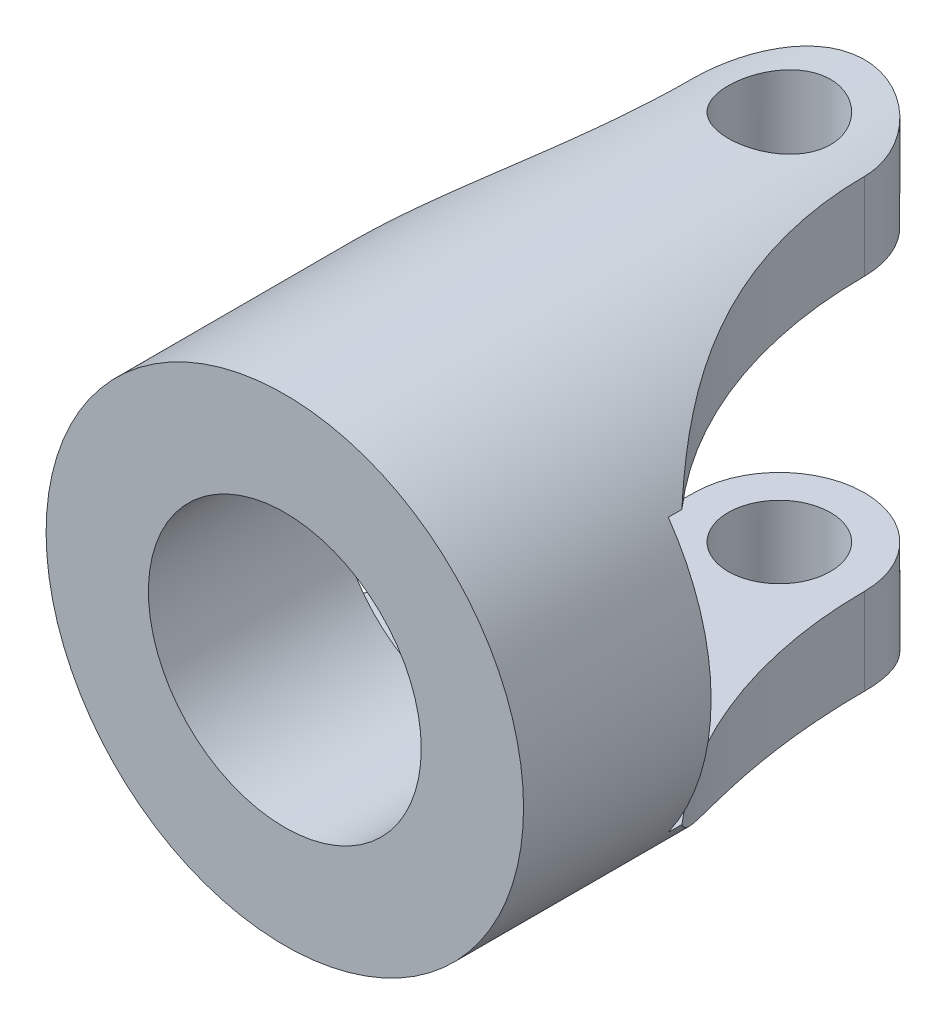
ISO-10303-21;
HEADER;
FILE_DESCRIPTION(('STEP AP214'),'2;1');
FILE_NAME('part.step','',(''),(''),'','','');
FILE_SCHEMA(('AUTOMOTIVE_DESIGN { 1 0 10303 214 1 1 1 1 }'));
ENDSEC;
DATA;
#1=APPLICATION_CONTEXT('core data for automotive mechanical design processes');
#2=APPLICATION_PROTOCOL_DEFINITION('international standard','automotive_design',2000,#1);
#3=PRODUCT_CONTEXT('',#1,'mechanical');
#4=PRODUCT('Part','Part','',(#3));
#5=PRODUCT_RELATED_PRODUCT_CATEGORY('part','',(#4));
#6=PRODUCT_DEFINITION_FORMATION('','',#4);
#7=PRODUCT_DEFINITION_CONTEXT('part definition',#1,'design');
#8=PRODUCT_DEFINITION('design','',#6,#7);
#9=PRODUCT_DEFINITION_SHAPE('','',#8);
#10=(LENGTH_UNIT() NAMED_UNIT(*) SI_UNIT(.MILLI.,.METRE.));
#11=(NAMED_UNIT(*) PLANE_ANGLE_UNIT() SI_UNIT($,.RADIAN.));
#12=(NAMED_UNIT(*) SI_UNIT($,.STERADIAN.) SOLID_ANGLE_UNIT());
#13=UNCERTAINTY_MEASURE_WITH_UNIT(LENGTH_MEASURE(1.E-05),#10,'distance_accuracy_value','');
#14=(GEOMETRIC_REPRESENTATION_CONTEXT(3) GLOBAL_UNCERTAINTY_ASSIGNED_CONTEXT((#13)) GLOBAL_UNIT_ASSIGNED_CONTEXT((#10,
#11,#12)) REPRESENTATION_CONTEXT('',''));
#15=CARTESIAN_POINT('',(0.,0.,0.));
#16=DIRECTION('',(0.,0.,1.));
#17=DIRECTION('',(1.,0.,0.));
#18=AXIS2_PLACEMENT_3D('',#15,#16,#17);
#19=CARTESIAN_POINT('',(15.5252924641516,-7.,2.49999999999999));
#20=DIRECTION('',(0.,1.,0.));
#21=DIRECTION('',(0.,0.,1.));
#22=AXIS2_PLACEMENT_3D('',#19,#20,#21);
#23=CYLINDRICAL_SURFACE('',#22,13.0252924641516);
#24=CARTESIAN_POINT('',(15.5252924641516,-4.,2.49999999999999));
#25=DIRECTION('',(0.,-1.,0.));
#26=DIRECTION('',(0.,0.,-1.));
#27=AXIS2_PLACEMENT_3D('',#24,#25,#26);
#28=CIRCLE('',#27,13.0252924641516);
#29=CARTESIAN_POINT('',(5.74456264653803,-4.,11.1020676590881));
#30=VERTEX_POINT('',#29);
#31=CARTESIAN_POINT('',(2.5,-4.,2.50000000000001));
#32=VERTEX_POINT('',#31);
#33=EDGE_CURVE('E214',#30,#32,#28,.T.);
#34=ORIENTED_EDGE('',*,*,#33,.F.);
#35=CARTESIAN_POINT('',(6.10944179749996,-3.41682907429687,11.5));
#36=CARTESIAN_POINT('',(6.02615043612414,-3.56583011685911,11.4128922592232));
#37=CARTESIAN_POINT('',(5.93902004569658,-3.70876486377794,11.3192863437269));
#38=CARTESIAN_POINT('',(5.75940528894502,-3.98193374571365,11.1199480037747));
#39=CARTESIAN_POINT('',(5.66692806532726,-4.11218422791262,11.0142315801889));
#40=CARTESIAN_POINT('',(5.47968286985627,-4.35853393156056,10.7924574427826));
#41=CARTESIAN_POINT('',(5.38494825839516,-4.47476496907049,10.6765173247532));
#42=CARTESIAN_POINT('',(5.19426751100973,-4.69476030451505,10.4342250507595));
#43=CARTESIAN_POINT('',(5.09832104261976,-4.7985210954455,10.3078699825658));
#44=CARTESIAN_POINT('',(4.90749815832674,-4.99349516349023,10.0463089632294));
#45=CARTESIAN_POINT('',(4.81261886046997,-5.0847633570035,9.91114587647508));
#46=CARTESIAN_POINT('',(4.62505937043369,-5.25594404672905,9.63241762070446));
#47=CARTESIAN_POINT('',(4.53237900874582,-5.3358574206296,9.48885310230227));
#48=CARTESIAN_POINT('',(4.350295714583,-5.48532966186036,9.19386345651681));
#49=CARTESIAN_POINT('',(4.26090170826441,-5.55486170298489,9.0424192826546));
#50=CARTESIAN_POINT('',(4.08671421862338,-5.6842356068071,8.73287615977507));
#51=CARTESIAN_POINT('',(4.0019217807948,-5.74407527343887,8.57477571279684));
#52=CARTESIAN_POINT('',(3.79560692774973,-5.88352862694064,8.1698795969028));
#53=CARTESIAN_POINT('',(3.67763284116535,-5.95747548144471,7.91930174018784));
#54=CARTESIAN_POINT('',(3.45656932715421,-6.08840179823093,7.40734393368045));
#55=CARTESIAN_POINT('',(3.35348653643574,-6.14537370711494,7.14595923386569));
#56=CARTESIAN_POINT('',(3.1635899931753,-6.24525636318539,6.61417438857178));
#57=CARTESIAN_POINT('',(3.07680820762161,-6.28813960265417,6.34375772867159));
#58=CARTESIAN_POINT('',(2.92081194382843,-6.36209962505024,5.7964055045007));
#59=CARTESIAN_POINT('',(2.85159374081515,-6.39317891198104,5.51947133605818));
#60=CARTESIAN_POINT('',(2.74308417319234,-6.44036123320998,5.01522442565958));
#61=CARTESIAN_POINT('',(2.7005897488202,-6.45820221408665,4.78875303305601));
#62=CARTESIAN_POINT('',(2.62763520223921,-6.4882265935956,4.33352453024262));
#63=CARTESIAN_POINT('',(2.59717406482752,-6.50041046951162,4.10476761452396));
#64=CARTESIAN_POINT('',(2.54857453262386,-6.51962297808358,3.64703753769739));
#65=CARTESIAN_POINT('',(2.53036805587216,-6.52668011052402,3.41807276830655));
#66=CARTESIAN_POINT('',(2.50607587658973,-6.53602376421927,2.95940440200552));
#67=CARTESIAN_POINT('',(2.49999011989542,-6.53831030679232,2.72970080840149));
#68=CARTESIAN_POINT('',(2.5,-6.53834841531101,2.5));
#69=B_SPLINE_CURVE_WITH_KNOTS('',3,(#35,#36,#37,#38,#39,#40,#41,#42,#43,#44,#45,#46,#47,#48,#49,
#50,#51,#52,#53,#54,#55,#56,#57,#58,#59,#60,#61,#62,#63,#64,#65,#66,#67,#68),.UNSPECIFIED.,.F.,
.F.,(4,2,2,2,2,2,2,2,2,2,2,2,2,2,2,2,4),(0.,0.574549319111911,1.14834809142456,1.71624292242607,
2.28429709046261,2.84976791821522,3.41519501322283,3.98205882849159,4.54905090274943,
5.40776572527381,6.26686208429532,7.1276259711365,7.98820715974643,8.68116528098377,
9.37406492747738,10.0630826089893,10.7520972114966),.UNSPECIFIED.);
#70=CARTESIAN_POINT('',(2.5,-6.53834841531101,2.50000000000001));
#71=VERTEX_POINT('',#70);
#72=EDGE_CURVE('E298',#30,#71,#69,.T.);
#73=ORIENTED_EDGE('',*,*,#72,.T.);
#74=DIRECTION('',(0.,1.,0.));
#75=VECTOR('',#74,1.);
#76=CARTESIAN_POINT('',(2.5,-7.,2.50000000000001));
#77=LINE('',#76,#75);
#78=EDGE_CURVE('E226',#71,#32,#77,.T.);
#79=ORIENTED_EDGE('',*,*,#78,.T.);
#80=EDGE_LOOP('',(#34,#73,#79));
#81=FACE_BOUND('',#80,.T.);
#82=ADVANCED_FACE('F103',(#81),#23,.F.);
#83=CARTESIAN_POINT('',(-15.5252924641516,-7.,2.5));
#84=DIRECTION('',(0.,1.,0.));
#85=DIRECTION('',(0.,0.,1.));
#86=AXIS2_PLACEMENT_3D('',#83,#84,#85);
#87=CYLINDRICAL_SURFACE('',#86,13.0252924641516);
#88=CARTESIAN_POINT('',(-6.10944179749996,-3.41682907429687,11.5));
#89=CARTESIAN_POINT('',(-6.02615043612414,-3.56583011685911,11.4128922592233));
#90=CARTESIAN_POINT('',(-5.93902004569658,-3.70876486377794,11.319286343727));
#91=CARTESIAN_POINT('',(-5.75940528894502,-3.98193374571365,11.1199480037748));
#92=CARTESIAN_POINT('',(-5.66692806532726,-4.11218422791262,11.0142315801889));
#93=CARTESIAN_POINT('',(-5.47968286985627,-4.35853393156056,10.7924574427827));
#94=CARTESIAN_POINT('',(-5.38494825839516,-4.47476496907049,10.6765173247532));
#95=CARTESIAN_POINT('',(-5.19426751100972,-4.69476030451505,10.4342250507595));
#96=CARTESIAN_POINT('',(-5.09832104261976,-4.7985210954455,10.3078699825658));
#97=CARTESIAN_POINT('',(-4.90749815832674,-4.99349516349023,10.0463089632294));
#98=CARTESIAN_POINT('',(-4.81261886046997,-5.0847633570035,9.91114587647508));
#99=CARTESIAN_POINT('',(-4.62505937043368,-5.25594404672905,9.63241762070447));
#100=CARTESIAN_POINT('',(-4.53237900874582,-5.3358574206296,9.48885310230227));
#101=CARTESIAN_POINT('',(-4.350295714583,-5.48532966186036,9.19386345651681));
#102=CARTESIAN_POINT('',(-4.2609017082644,-5.55486170298489,9.04241928265461));
#103=CARTESIAN_POINT('',(-4.08671421862337,-5.68423560680711,8.73287615977508));
#104=CARTESIAN_POINT('',(-4.0019217807948,-5.74407527343887,8.57477571279685));
#105=CARTESIAN_POINT('',(-3.79560692774972,-5.88352862694064,8.1698795969028));
#106=CARTESIAN_POINT('',(-3.67763284116535,-5.95747548144471,7.91930174018785));
#107=CARTESIAN_POINT('',(-3.45656932715421,-6.08840179823093,7.40734393368045));
#108=CARTESIAN_POINT('',(-3.35348653643574,-6.14537370711494,7.14595923386569));
#109=CARTESIAN_POINT('',(-3.1635899931753,-6.24525636318539,6.61417438857178));
#110=CARTESIAN_POINT('',(-3.07680820762161,-6.28813960265417,6.3437577286716));
#111=CARTESIAN_POINT('',(-2.92081194382843,-6.36209962505024,5.7964055045007));
#112=CARTESIAN_POINT('',(-2.85159374081515,-6.39317891198104,5.51947133605819));
#113=CARTESIAN_POINT('',(-2.74308417319234,-6.44036123320998,5.01522442565958));
#114=CARTESIAN_POINT('',(-2.7005897488202,-6.45820221408665,4.78875303305601));
#115=CARTESIAN_POINT('',(-2.62763520223921,-6.48822659359561,4.33352453024262));
#116=CARTESIAN_POINT('',(-2.59717406482752,-6.50041046951162,4.10476761452397));
#117=CARTESIAN_POINT('',(-2.54857453262385,-6.51962297808358,3.64703753769739));
#118=CARTESIAN_POINT('',(-2.53036805587215,-6.52668011052402,3.41807276830655));
#119=CARTESIAN_POINT('',(-2.50607587658973,-6.53602376421927,2.95940440200552));
#120=CARTESIAN_POINT('',(-2.49999011989542,-6.53831030679232,2.72970080840149));
#121=CARTESIAN_POINT('',(-2.5,-6.53834841531101,2.5));
#122=B_SPLINE_CURVE_WITH_KNOTS('',3,(#88,#89,#90,#91,#92,#93,#94,#95,#96,#97,#98,#99,#100,#101,
#102,#103,#104,#105,#106,#107,#108,#109,#110,#111,#112,#113,#114,#115,#116,#117,#118,#119,#120,
#121),.UNSPECIFIED.,.F.,.F.,(4,2,2,2,2,2,2,2,2,2,2,2,2,2,2,2,4),(0.,0.57454931911191,
1.14834809142456,1.71624292242607,2.28429709046262,2.84976791821522,3.41519501322284,
3.98205882849159,4.54905090274943,5.40776572527381,6.26686208429533,7.1276259711365,
7.98820715974643,8.68116528098377,9.37406492747738,10.0630826089894,10.7520972114966),.UNSPECIFIED.);
#123=CARTESIAN_POINT('',(-5.74456264653803,-4.,11.1020676590881));
#124=VERTEX_POINT('',#123);
#125=CARTESIAN_POINT('',(-2.5,-6.53834841531101,2.5));
#126=VERTEX_POINT('',#125);
#127=EDGE_CURVE('E320',#124,#126,#122,.T.);
#128=ORIENTED_EDGE('',*,*,#127,.F.);
#129=CARTESIAN_POINT('',(-15.5252924641516,-4.,2.5));
#130=DIRECTION('',(0.,-1.,0.));
#131=DIRECTION('',(0.,0.,-1.));
#132=AXIS2_PLACEMENT_3D('',#129,#130,#131);
#133=CIRCLE('',#132,13.0252924641516);
#134=CARTESIAN_POINT('',(-2.5,-4.,2.5));
#135=VERTEX_POINT('',#134);
#136=EDGE_CURVE('E12',#124,#135,#133,.F.);
#137=ORIENTED_EDGE('',*,*,#136,.T.);
#138=DIRECTION('',(0.,1.,0.));
#139=VECTOR('',#138,1.);
#140=CARTESIAN_POINT('',(-2.5,-7.,2.5));
#141=LINE('',#140,#139);
#142=EDGE_CURVE('E229',#126,#135,#141,.T.);
#143=ORIENTED_EDGE('',*,*,#142,.F.);
#144=EDGE_LOOP('',(#128,#137,#143));
#145=FACE_BOUND('',#144,.T.);
#146=ADVANCED_FACE('F265',(#145),#87,.F.);
#147=CARTESIAN_POINT('',(0.,0.,17.));
#148=DIRECTION('',(0.,0.,-1.));
#149=DIRECTION('',(-1.,0.,0.));
#150=AXIS2_PLACEMENT_3D('',#147,#148,#149);
#151=CYLINDRICAL_SURFACE('',#150,7.);
#152=CARTESIAN_POINT('',(0.,-7.,4.));
#153=CARTESIAN_POINT('',(0.0832358860906169,-6.99999846043226,3.9999971004257));
#154=CARTESIAN_POINT('',(0.166507195600275,-6.9985002594971,3.99304839161214));
#155=CARTESIAN_POINT('',(0.330687344293328,-6.99266829827728,3.96546434314641));
#156=CARTESIAN_POINT('',(0.41159440357119,-6.98833245637099,3.94481895580507));
#157=CARTESIAN_POINT('',(0.568649323817737,-6.97730831788827,3.89051563539196));
#158=CARTESIAN_POINT('',(0.644801963446556,-6.97062242967171,3.85687102061868));
#159=CARTESIAN_POINT('',(0.790378177960787,-6.95562106817971,3.77756591382874));
#160=CARTESIAN_POINT('',(0.85980198174737,-6.94730565036661,3.73190583075006));
#161=CARTESIAN_POINT('',(0.99102479053523,-6.92981369246311,3.62911970032649));
#162=CARTESIAN_POINT('',(1.05270503419445,-6.92062683143259,3.57184377810147));
#163=CARTESIAN_POINT('',(1.16566042389435,-6.90250069814144,3.4477736843148));
#164=CARTESIAN_POINT('',(1.21693467150908,-6.8935614473163,3.38097869174874));
#165=CARTESIAN_POINT('',(1.30814204379809,-6.87684116047225,3.23889424713957));
#166=CARTESIAN_POINT('',(1.34794958335009,-6.8690733634436,3.16352248224379));
#167=CARTESIAN_POINT('',(1.41428823691148,-6.85572325558537,3.00696554623316));
#168=CARTESIAN_POINT('',(1.44082087001716,-6.85014069470711,2.92578104150743));
#169=CARTESIAN_POINT('',(1.47946574422454,-6.84189808926311,2.76118891341193));
#170=CARTESIAN_POINT('',(1.49178779748342,-6.83919556896486,2.67783272433614));
#171=CARTESIAN_POINT('',(1.50231395206577,-6.83689139845106,2.51019576749301));
#172=CARTESIAN_POINT('',(1.50051971664629,-6.83728938291729,2.42591510982005));
#173=CARTESIAN_POINT('',(1.48303326340861,-6.84110276603832,2.26037531206621));
#174=CARTESIAN_POINT('',(1.46758398649408,-6.84446541682162,2.17908911089985));
#175=CARTESIAN_POINT('',(1.42361054298677,-6.85374593375788,2.02028975971066));
#176=CARTESIAN_POINT('',(1.39508566936466,-6.85966393808402,1.94277681396768));
#177=CARTESIAN_POINT('',(1.32554551075991,-6.87344080755724,1.79303712712666));
#178=CARTESIAN_POINT('',(1.2844361097283,-6.88131420983365,1.72085548728745));
#179=CARTESIAN_POINT('',(1.19096007283993,-6.89810572501288,1.58432483504204));
#180=CARTESIAN_POINT('',(1.13859196103562,-6.90702397481896,1.5199768513138));
#181=CARTESIAN_POINT('',(1.0227954275532,-6.92512718393878,1.3995406443266));
#182=CARTESIAN_POINT('',(0.95916023396441,-6.93431383972178,1.34365129341526));
#183=CARTESIAN_POINT('',(0.823317306269097,-6.95175017497059,1.24330626631034));
#184=CARTESIAN_POINT('',(0.7511094287754,-6.95999983875972,1.19885078139961));
#185=CARTESIAN_POINT('',(0.599933462049959,-6.97465778534003,1.12258932009307));
#186=CARTESIAN_POINT('',(0.520952258863483,-6.98106238643354,1.09080858742202));
#187=CARTESIAN_POINT('',(0.358603146685706,-6.99128109245334,1.04102435167891));
#188=CARTESIAN_POINT('',(0.275235851133669,-6.99509555860384,1.02301892743668));
#189=CARTESIAN_POINT('',(0.108187670836629,-6.99965306347808,1.00158378585658));
#190=CARTESIAN_POINT('',(0.0245431772716146,-7.00045336521066,0.99788228711822));
#191=CARTESIAN_POINT('',(-0.142168973650405,-6.99905248935969,1.00442457112516));
#192=CARTESIAN_POINT('',(-0.225236668127255,-6.99685150675698,1.01466744796294));
#193=CARTESIAN_POINT('',(-0.387542537982806,-6.98973143045266,1.0485822436617));
#194=CARTESIAN_POINT('',(-0.466811712908477,-6.9848410504546,1.07211236947253));
#195=CARTESIAN_POINT('',(-0.620278450473418,-6.9728892442151,1.13177694299482));
#196=CARTESIAN_POINT('',(-0.69447559258774,-6.96582763822237,1.16791243431165));
#197=CARTESIAN_POINT('',(-0.836821397964753,-6.950175043904,1.25233354306033));
#198=CARTESIAN_POINT('',(-0.90487257511114,-6.94156431354275,1.30077979490973));
#199=CARTESIAN_POINT('',(-1.0319769255236,-6.92381033034847,1.40823482488874));
#200=CARTESIAN_POINT('',(-1.091028978692,-6.91466701142097,1.46724491588744));
#201=CARTESIAN_POINT('',(-1.19952711057989,-6.89668172706324,1.59539737018714));
#202=CARTESIAN_POINT('',(-1.24878537255156,-6.88784792221285,1.6647000992221));
#203=CARTESIAN_POINT('',(-1.3349641538604,-6.87166654559681,1.81075459647799));
#204=CARTESIAN_POINT('',(-1.37188519913706,-6.86431891048055,1.88750604697749));
#205=CARTESIAN_POINT('',(-1.43209741248548,-6.8520100980739,2.0458722989946));
#206=CARTESIAN_POINT('',(-1.45546398641275,-6.84703574582967,2.12745735643067));
#207=CARTESIAN_POINT('',(-1.48812696085335,-6.84001186708418,2.29351558383364));
#208=CARTESIAN_POINT('',(-1.49742550780258,-6.83796189439706,2.37798831120132));
#209=CARTESIAN_POINT('',(-1.5015999992604,-6.83704618848155,2.54553234317524));
#210=CARTESIAN_POINT('',(-1.49677347258311,-6.83811476518543,2.62859601498058));
#211=CARTESIAN_POINT('',(-1.47349789406331,-6.8431676318483,2.79269724213259));
#212=CARTESIAN_POINT('',(-1.45504898957979,-6.84715189026714,2.87373481938657));
#213=CARTESIAN_POINT('',(-1.40519345940434,-6.85755581104157,3.03125865786917));
#214=CARTESIAN_POINT('',(-1.37382847170887,-6.86396764224703,3.10775864866429));
#215=CARTESIAN_POINT('',(-1.29906751595601,-6.87850764590649,3.25445537250685));
#216=CARTESIAN_POINT('',(-1.255670353015,-6.88663598880363,3.32465147861504));
#217=CARTESIAN_POINT('',(-1.15708290349304,-6.90389055593232,3.45821819372537));
#218=CARTESIAN_POINT('',(-1.10167987421237,-6.91303309938926,3.52142969594698));
#219=CARTESIAN_POINT('',(-0.981086554619621,-6.93117449799694,3.63775626252046));
#220=CARTESIAN_POINT('',(-0.915894009385597,-6.94017331951296,3.69086899431221));
#221=CARTESIAN_POINT('',(-0.776603147268716,-6.95714491048987,3.78611595950556));
#222=CARTESIAN_POINT('',(-0.70240484600964,-6.96510364570626,3.82810660623098));
#223=CARTESIAN_POINT('',(-0.547850160940597,-6.97895826104019,3.89895452890618));
#224=CARTESIAN_POINT('',(-0.467499105863879,-6.98485590212343,3.92782302258504));
#225=CARTESIAN_POINT('',(-0.322535217553204,-6.99284848461772,3.96635218513115));
#226=CARTESIAN_POINT('',(-0.258717205545979,-6.99551391888263,3.97894643398003));
#227=CARTESIAN_POINT('',(-0.129939960853847,-6.99909024154719,3.99577130171167));
#228=CARTESIAN_POINT('',(-0.064980775088745,-7.00000120191314,4.00000226364606));
#229=CARTESIAN_POINT('',(0.,-7.,4.));
#230=B_SPLINE_CURVE_WITH_KNOTS('',3,(#152,#153,#154,#155,#156,#157,#158,#159,#160,#161,#162,
#163,#164,#165,#166,#167,#168,#169,#170,#171,#172,#173,#174,#175,#176,#177,#178,#179,#180,#181,
#182,#183,#184,#185,#186,#187,#188,#189,#190,#191,#192,#193,#194,#195,#196,#197,#198,#199,#200,
#201,#202,#203,#204,#205,#206,#207,#208,#209,#210,#211,#212,#213,#214,#215,#216,#217,#218,#219,
#220,#221,#222,#223,#224,#225,#226,#227,#228,#229),.UNSPECIFIED.,.T.,.F.,(4,2,2,2,2,2,2,2,2,2,2,
2,2,2,2,2,2,2,2,2,2,2,2,2,2,2,2,2,2,2,2,2,2,2,2,2,2,2,4),(0.,0.249469836512082,
0.499122883219936,0.748520824425602,0.997910278645886,1.25074961881732,1.50361077918506,
1.7591442921451,2.0146485567749,2.26633008124666,2.51798195169165,2.76524475452928,
3.01252092904568,3.26169356165968,3.51089887920889,3.76527011050291,4.0196455970235,
4.27452521139806,4.52936927256343,4.77934665704185,5.02930780231429,5.27665060589267,
5.52401389198434,5.77478733867803,6.02559197304485,6.28082063283534,6.53603841075806,
6.78982240408475,7.04356767229185,7.29200680540294,7.5404432510827,7.78808499706785,
8.03575134451623,8.28822950154114,8.54076590397115,8.79641910357222,9.05185334010271,
9.24661799132294,9.44137465337336),.UNSPECIFIED.);
#231=CARTESIAN_POINT('',(0.,-7.,4.));
#232=VERTEX_POINT('',#231);
#233=EDGE_CURVE('E237',#232,#232,#230,.T.);
#234=ORIENTED_EDGE('',*,*,#233,.T.);
#235=EDGE_LOOP('',(#234));
#236=FACE_BOUND('',#235,.T.);
#237=CARTESIAN_POINT('',(0.,7.,4.));
#238=CARTESIAN_POINT('',(-0.0832358860906166,6.99999846043226,3.9999971004257));
#239=CARTESIAN_POINT('',(-0.166507195600275,6.9985002594971,3.99304839161214));
#240=CARTESIAN_POINT('',(-0.330687344293327,6.99266829827728,3.96546434314641));
#241=CARTESIAN_POINT('',(-0.41159440357119,6.98833245637099,3.94481895580507));
#242=CARTESIAN_POINT('',(-0.568649323817736,6.97730831788826,3.89051563539196));
#243=CARTESIAN_POINT('',(-0.644801963446555,6.97062242967171,3.85687102061868));
#244=CARTESIAN_POINT('',(-0.790378177960787,6.95562106817971,3.77756591382874));
#245=CARTESIAN_POINT('',(-0.859801981747369,6.94730565036661,3.73190583075006));
#246=CARTESIAN_POINT('',(-0.991024790535229,6.92981369246311,3.62911970032649));
#247=CARTESIAN_POINT('',(-1.05270503419445,6.92062683143259,3.57184377810147));
#248=CARTESIAN_POINT('',(-1.16566042389435,6.90250069814144,3.4477736843148));
#249=CARTESIAN_POINT('',(-1.21693467150908,6.8935614473163,3.38097869174874));
#250=CARTESIAN_POINT('',(-1.30814204379809,6.87684116047225,3.23889424713957));
#251=CARTESIAN_POINT('',(-1.34794958335009,6.8690733634436,3.16352248224379));
#252=CARTESIAN_POINT('',(-1.41428823691148,6.85572325558537,3.00696554623316));
#253=CARTESIAN_POINT('',(-1.44082087001716,6.85014069470711,2.92578104150743));
#254=CARTESIAN_POINT('',(-1.47946574422454,6.84189808926311,2.76118891341193));
#255=CARTESIAN_POINT('',(-1.49178779748342,6.83919556896486,2.67783272433614));
#256=CARTESIAN_POINT('',(-1.50231395206577,6.83689139845106,2.51019576749301));
#257=CARTESIAN_POINT('',(-1.50051971664629,6.83728938291729,2.42591510982005));
#258=CARTESIAN_POINT('',(-1.48303326340861,6.84110276603832,2.26037531206621));
#259=CARTESIAN_POINT('',(-1.46758398649408,6.84446541682162,2.17908911089985));
#260=CARTESIAN_POINT('',(-1.42361054298677,6.85374593375788,2.02028975971066));
#261=CARTESIAN_POINT('',(-1.39508566936466,6.85966393808402,1.94277681396768));
#262=CARTESIAN_POINT('',(-1.32554551075991,6.87344080755724,1.79303712712666));
#263=CARTESIAN_POINT('',(-1.2844361097283,6.88131420983365,1.72085548728745));
#264=CARTESIAN_POINT('',(-1.19096007283993,6.89810572501288,1.58432483504204));
#265=CARTESIAN_POINT('',(-1.13859196103562,6.90702397481896,1.5199768513138));
#266=CARTESIAN_POINT('',(-1.0227954275532,6.92512718393878,1.3995406443266));
#267=CARTESIAN_POINT('',(-0.95916023396441,6.93431383972178,1.34365129341526));
#268=CARTESIAN_POINT('',(-0.823317306269096,6.95175017497059,1.24330626631034));
#269=CARTESIAN_POINT('',(-0.751109428775399,6.95999983875972,1.19885078139961));
#270=CARTESIAN_POINT('',(-0.599933462049958,6.97465778534003,1.12258932009307));
#271=CARTESIAN_POINT('',(-0.520952258863482,6.98106238643354,1.09080858742202));
#272=CARTESIAN_POINT('',(-0.358603146685705,6.99128109245334,1.04102435167891));
#273=CARTESIAN_POINT('',(-0.275235851133668,6.99509555860384,1.02301892743668));
#274=CARTESIAN_POINT('',(-0.108187670836628,6.99965306347808,1.00158378585658));
#275=CARTESIAN_POINT('',(-0.0245431772716139,7.00045336521066,0.99788228711822));
#276=CARTESIAN_POINT('',(0.142168973650406,6.99905248935969,1.00442457112516));
#277=CARTESIAN_POINT('',(0.225236668127256,6.99685150675698,1.01466744796294));
#278=CARTESIAN_POINT('',(0.387542537982807,6.98973143045266,1.0485822436617));
#279=CARTESIAN_POINT('',(0.466811712908479,6.9848410504546,1.07211236947253));
#280=CARTESIAN_POINT('',(0.620278450473419,6.9728892442151,1.13177694299482));
#281=CARTESIAN_POINT('',(0.694475592587741,6.96582763822237,1.16791243431166));
#282=CARTESIAN_POINT('',(0.836821397964755,6.950175043904,1.25233354306033));
#283=CARTESIAN_POINT('',(0.904872575111142,6.94156431354275,1.30077979490973));
#284=CARTESIAN_POINT('',(1.0319769255236,6.92381033034847,1.40823482488874));
#285=CARTESIAN_POINT('',(1.091028978692,6.91466701142097,1.46724491588744));
#286=CARTESIAN_POINT('',(1.19952711057989,6.89668172706324,1.59539737018714));
#287=CARTESIAN_POINT('',(1.24878537255157,6.88784792221285,1.6647000992221));
#288=CARTESIAN_POINT('',(1.33496415386041,6.87166654559681,1.81075459647799));
#289=CARTESIAN_POINT('',(1.37188519913706,6.86431891048055,1.88750604697749));
#290=CARTESIAN_POINT('',(1.43209741248548,6.8520100980739,2.0458722989946));
#291=CARTESIAN_POINT('',(1.45546398641275,6.84703574582967,2.12745735643067));
#292=CARTESIAN_POINT('',(1.48812696085335,6.84001186708418,2.29351558383364));
#293=CARTESIAN_POINT('',(1.49742550780258,6.83796189439706,2.37798831120132));
#294=CARTESIAN_POINT('',(1.5015999992604,6.83704618848155,2.54553234317524));
#295=CARTESIAN_POINT('',(1.49677347258311,6.83811476518543,2.62859601498058));
#296=CARTESIAN_POINT('',(1.47349789406331,6.8431676318483,2.79269724213259));
#297=CARTESIAN_POINT('',(1.45504898957979,6.84715189026714,2.87373481938657));
#298=CARTESIAN_POINT('',(1.40519345940434,6.85755581104157,3.03125865786917));
#299=CARTESIAN_POINT('',(1.37382847170887,6.86396764224703,3.10775864866429));
#300=CARTESIAN_POINT('',(1.29906751595601,6.87850764590649,3.25445537250685));
#301=CARTESIAN_POINT('',(1.255670353015,6.88663598880363,3.32465147861505));
#302=CARTESIAN_POINT('',(1.15708290349304,6.90389055593232,3.45821819372537));
#303=CARTESIAN_POINT('',(1.10167987421237,6.91303309938927,3.52142969594698));
#304=CARTESIAN_POINT('',(0.98108655461962,6.93117449799694,3.63775626252046));
#305=CARTESIAN_POINT('',(0.915894009385596,6.94017331951296,3.69086899431221));
#306=CARTESIAN_POINT('',(0.776603147268716,6.95714491048987,3.78611595950556));
#307=CARTESIAN_POINT('',(0.70240484600964,6.96510364570626,3.82810660623098));
#308=CARTESIAN_POINT('',(0.547850160940597,6.97895826104019,3.89895452890618));
#309=CARTESIAN_POINT('',(0.467499105863879,6.98485590212343,3.92782302258504));
#310=CARTESIAN_POINT('',(0.322535217553204,6.99284848461772,3.96635218513115));
#311=CARTESIAN_POINT('',(0.258717205545979,6.99551391888263,3.97894643398003));
#312=CARTESIAN_POINT('',(0.129939960853847,6.99909024154719,3.99577130171167));
#313=CARTESIAN_POINT('',(0.0649807750887453,7.00000120191314,4.00000226364606));
#314=CARTESIAN_POINT('',(0.,7.,4.));
#315=B_SPLINE_CURVE_WITH_KNOTS('',3,(#237,#238,#239,#240,#241,#242,#243,#244,#245,#246,#247,
#248,#249,#250,#251,#252,#253,#254,#255,#256,#257,#258,#259,#260,#261,#262,#263,#264,#265,#266,
#267,#268,#269,#270,#271,#272,#273,#274,#275,#276,#277,#278,#279,#280,#281,#282,#283,#284,#285,
#286,#287,#288,#289,#290,#291,#292,#293,#294,#295,#296,#297,#298,#299,#300,#301,#302,#303,#304,
#305,#306,#307,#308,#309,#310,#311,#312,#313,#314),.UNSPECIFIED.,.T.,.F.,(4,2,2,2,2,2,2,2,2,2,2,
2,2,2,2,2,2,2,2,2,2,2,2,2,2,2,2,2,2,2,2,2,2,2,2,2,2,2,4),(0.,0.249469836512082,
0.499122883219936,0.748520824425602,0.997910278645886,1.25074961881732,1.50361077918506,
1.7591442921451,2.0146485567749,2.26633008124666,2.51798195169165,2.76524475452927,
3.01252092904568,3.26169356165968,3.51089887920889,3.76527011050291,4.0196455970235,
4.27452521139806,4.52936927256343,4.77934665704185,5.02930780231429,5.27665060589267,
5.52401389198434,5.77478733867803,6.02559197304485,6.28082063283534,6.53603841075806,
6.78982240408475,7.04356767229185,7.29200680540294,7.5404432510827,7.78808499706785,
8.03575134451623,8.28822950154114,8.54076590397115,8.79641910357222,9.05185334010271,
9.24661799132294,9.44137465337336),.UNSPECIFIED.);
#316=CARTESIAN_POINT('',(0.,7.,4.));
#317=VERTEX_POINT('',#316);
#318=EDGE_CURVE('E230',#317,#317,#315,.T.);
#319=ORIENTED_EDGE('',*,*,#318,.T.);
#320=EDGE_LOOP('',(#319));
#321=FACE_BOUND('',#320,.T.);
#322=CARTESIAN_POINT('',(0.,0.,17.));
#323=DIRECTION('',(0.,0.,1.));
#324=DIRECTION('',(1.,0.,0.));
#325=AXIS2_PLACEMENT_3D('',#322,#323,#324);
#326=CIRCLE('',#325,7.);
#327=CARTESIAN_POINT('',(7.,0.,17.));
#328=VERTEX_POINT('',#327);
#329=EDGE_CURVE('E182',#328,#328,#326,.T.);
#330=ORIENTED_EDGE('',*,*,#329,.F.);
#331=EDGE_LOOP('',(#330));
#332=FACE_BOUND('',#331,.T.);
#333=ORIENTED_EDGE('',*,*,#72,.F.);
#334=DIRECTION('',(0.,0.,-1.));
#335=VECTOR('',#334,1.);
#336=CARTESIAN_POINT('',(5.74456264653803,-4.,17.));
#337=LINE('',#336,#335);
#338=CARTESIAN_POINT('',(5.74456264653803,-4.,11.5));
#339=VERTEX_POINT('',#338);
#340=EDGE_CURVE('E221',#30,#339,#337,.F.);
#341=ORIENTED_EDGE('',*,*,#340,.T.);
#342=CARTESIAN_POINT('',(0.,0.,11.5));
#343=DIRECTION('',(0.,0.,1.));
#344=DIRECTION('',(1.,0.,0.));
#345=AXIS2_PLACEMENT_3D('',#342,#343,#344);
#346=CIRCLE('',#345,7.);
#347=CARTESIAN_POINT('',(5.74456264653803,4.,11.5));
#348=VERTEX_POINT('',#347);
#349=EDGE_CURVE('E181',#339,#348,#346,.T.);
#350=ORIENTED_EDGE('',*,*,#349,.T.);
#351=DIRECTION('',(0.,0.,-1.));
#352=VECTOR('',#351,1.);
#353=CARTESIAN_POINT('',(5.74456264653803,4.,17.));
#354=LINE('',#353,#352);
#355=CARTESIAN_POINT('',(5.74456264653803,4.,11.1020676590881));
#356=VERTEX_POINT('',#355);
#357=EDGE_CURVE('E206',#348,#356,#354,.T.);
#358=ORIENTED_EDGE('',*,*,#357,.T.);
#359=CARTESIAN_POINT('',(2.5,6.53834841531101,2.5));
#360=CARTESIAN_POINT('',(2.49999979842075,6.53834329458002,2.64746969525571));
#361=CARTESIAN_POINT('',(2.50250479738911,6.53739138411626,2.79492603912229));
#362=CARTESIAN_POINT('',(2.51251766008846,6.53355157157986,3.08964274533865));
#363=CARTESIAN_POINT('',(2.52002550007972,6.53066367869395,3.23690310861507));
#364=CARTESIAN_POINT('',(2.55004721508262,6.51903037972077,3.67821488284086));
#365=CARTESIAN_POINT('',(2.58005927807908,6.50731531160611,3.97172012912305));
#366=CARTESIAN_POINT('',(2.66010184935566,6.47500772141493,4.55744440901881));
#367=CARTESIAN_POINT('',(2.71026250203612,6.45435741629375,4.84964234439619));
#368=CARTESIAN_POINT('',(2.83015836093061,6.40269265978861,5.42904162833688));
#369=CARTESIAN_POINT('',(2.89988995855423,6.37168011884577,5.71624388767064));
#370=CARTESIAN_POINT('',(3.05073535283646,6.30073598189347,6.25697436090016));
#371=CARTESIAN_POINT('',(3.13015368397299,6.26192245735674,6.51112239134669));
#372=CARTESIAN_POINT('',(3.30363843317706,6.17215647907451,7.01216845256362));
#373=CARTESIAN_POINT('',(3.39770267506798,6.12120582814045,7.25906755395559));
#374=CARTESIAN_POINT('',(3.59906545510124,6.0050151747281,7.74327581822914));
#375=CARTESIAN_POINT('',(3.70633273384144,5.93980865042356,7.98060593145696));
#376=CARTESIAN_POINT('',(3.93256389981785,5.79250818132623,8.44418406011799));
#377=CARTESIAN_POINT('',(4.05152383597922,5.71041993087862,8.67043578060643));
#378=CARTESIAN_POINT('',(4.26732355529784,5.55005620293725,9.05375930897385));
#379=CARTESIAN_POINT('',(4.36210763259961,5.47610769871861,9.21380666868343));
#380=CARTESIAN_POINT('',(4.55552082992297,5.31629252605639,9.52537864939061));
#381=CARTESIAN_POINT('',(4.65414894462486,5.23042895888186,9.67690547374994));
#382=CARTESIAN_POINT('',(4.85343176507397,5.04604462108303,9.97000357118143));
#383=CARTESIAN_POINT('',(4.95408094089959,4.94755523400688,10.1115982257567));
#384=CARTESIAN_POINT('',(5.15568830060262,4.73710097471489,10.3840532114661));
#385=CARTESIAN_POINT('',(5.25664638277348,4.62514015201882,10.5149167485881));
#386=CARTESIAN_POINT('',(5.48878540865718,4.34916273181446,10.804896043084));
#387=CARTESIAN_POINT('',(5.61931907235272,4.17994197229024,10.9596835841753));
#388=CARTESIAN_POINT('',(5.80877023762484,3.90775097668881,11.1750625934906));
#389=CARTESIAN_POINT('',(5.87100643171407,3.8137085959087,11.2442032082412));
#390=CARTESIAN_POINT('',(5.99258156160824,3.61968093679899,11.3765834859872));
#391=CARTESIAN_POINT('',(6.05191878593292,3.51969222331746,11.4398196827596));
#392=CARTESIAN_POINT('',(6.10944179749996,3.41682907429687,11.5));
#393=B_SPLINE_CURVE_WITH_KNOTS('',3,(#359,#360,#361,#362,#363,#364,#365,#366,#367,#368,#369,
#370,#371,#372,#373,#374,#375,#376,#377,#378,#379,#380,#381,#382,#383,#384,#385,#386,#387,#388,
#389,#390,#391,#392),.UNSPECIFIED.,.F.,.F.,(4,2,2,2,2,2,2,2,2,2,2,2,2,2,2,2,4),(0.,
0.44235787368227,0.884713648280506,1.7696551920032,2.66040713470775,3.55099494381633,
4.35752640913859,5.16393814937616,5.96847609197607,6.77274310110828,7.37273877124463,
7.97257856557948,8.57095526576621,9.16915254091488,9.95843297994858,10.3550132076035,
10.75182480515),.UNSPECIFIED.);
#394=CARTESIAN_POINT('',(2.5,6.53834841531101,2.50000000000001));
#395=VERTEX_POINT('',#394);
#396=EDGE_CURVE('E292',#395,#356,#393,.T.);
#397=ORIENTED_EDGE('',*,*,#396,.F.);
#398=CARTESIAN_POINT('',(-2.5,6.53834841531101,2.5));
#399=CARTESIAN_POINT('',(-2.50000932220903,6.53833653785133,2.43211075427107));
#400=CARTESIAN_POINT('',(-2.49723485076694,6.53940549922738,2.36422806736091));
#401=CARTESIAN_POINT('',(-2.4861910211816,6.54361657478134,2.22899608938858));
#402=CARTESIAN_POINT('',(-2.47792334551208,6.54675805418062,2.16164664139387));
#403=CARTESIAN_POINT('',(-2.456001752859,6.55501217637942,2.02817858539721));
#404=CARTESIAN_POINT('',(-2.44236559963955,6.56011831705676,1.96205666366019));
#405=CARTESIAN_POINT('',(-2.40985115466648,6.57213177854175,1.83129816489153));
#406=CARTESIAN_POINT('',(-2.39097263107435,6.57903917900746,1.76666165368758));
#407=CARTESIAN_POINT('',(-2.32673964179204,6.60214934365709,1.57573563352248));
#408=CARTESIAN_POINT('',(-2.27375112606986,6.62075475340845,1.45220954786442));
#409=CARTESIAN_POINT('',(-2.14910757865425,6.6622539736071,1.21576966687203));
#410=CARTESIAN_POINT('',(-2.07743895048849,6.68515090424876,1.10286368326448));
#411=CARTESIAN_POINT('',(-1.9140257110197,6.73379913792224,0.885784786647288));
#412=CARTESIAN_POINT('',(-1.82158337146744,6.75962864041371,0.782153524804123));
#413=CARTESIAN_POINT('',(-1.6207338877633,6.81057592323031,0.591491295283574));
#414=CARTESIAN_POINT('',(-1.51232377552673,6.83569357019868,0.504463420756647));
#415=CARTESIAN_POINT('',(-1.27853915335934,6.88331133279046,0.346910144545013));
#416=CARTESIAN_POINT('',(-1.15274833789185,6.90570835223797,0.276968478139459));
#417=CARTESIAN_POINT('',(-0.890250825476634,6.94442357672633,0.159463353202597));
#418=CARTESIAN_POINT('',(-0.753547890540326,6.96074386585465,0.111892220953989));
#419=CARTESIAN_POINT('',(-0.478829979256174,6.9849105051071,0.0423593978176369));
#420=CARTESIAN_POINT('',(-0.341079835227466,6.99306594352515,0.0194608695289188));
#421=CARTESIAN_POINT('',(-0.0634643052969029,7.00108798053822,-0.00306840277764484));
#422=CARTESIAN_POINT('',(0.076400484507449,7.00095687302702,-0.0027055860346511));
#423=CARTESIAN_POINT('',(0.347593258486947,6.99262258049077,0.0207112737611183));
#424=CARTESIAN_POINT('',(0.479022407078721,6.98478243583516,0.0427447941985288));
#425=CARTESIAN_POINT('',(0.736175812143608,6.96237832507347,0.107173424158804));
#426=CARTESIAN_POINT('',(0.861899745780465,6.94781397899037,0.149569684362522));
#427=CARTESIAN_POINT('',(1.10616102429807,6.91316506890369,0.254046911565323));
#428=CARTESIAN_POINT('',(1.22457279066906,6.89300592164314,0.316395714960124));
#429=CARTESIAN_POINT('',(1.44953531305523,6.8492335561632,0.45877933522336));
#430=CARTESIAN_POINT('',(1.5560824517677,6.82561928959263,0.538819523783594));
#431=CARTESIAN_POINT('',(1.7603244525607,6.7759054780549,0.719323263656699));
#432=CARTESIAN_POINT('',(1.85724185700418,6.74974055843875,0.820649723144899));
#433=CARTESIAN_POINT('',(2.03299914621296,6.69890342468975,1.03832736416557));
#434=CARTESIAN_POINT('',(2.11183255456462,6.67423174765257,1.15468390516847));
#435=CARTESIAN_POINT('',(2.25049860898459,6.62877803875405,1.40194259852198));
#436=CARTESIAN_POINT('',(2.30994207989626,6.60807875118994,1.53307897550541));
#437=CARTESIAN_POINT('',(2.4055543972585,6.57388213610267,1.80436480158219));
#438=CARTESIAN_POINT('',(2.44176119399954,6.56037307165053,1.94449914116898));
#439=CARTESIAN_POINT('',(2.47705497148627,6.54708542245562,2.15503054426421));
#440=CARTESIAN_POINT('',(2.48565347586445,6.54382010967907,2.22373630177179));
#441=CARTESIAN_POINT('',(2.49712352174882,6.53944910829676,2.3616151641917));
#442=CARTESIAN_POINT('',(2.50000139665367,6.53834103140935,2.43078766710052));
#443=CARTESIAN_POINT('',(2.5,6.53834841531101,2.50000000000001));
#444=B_SPLINE_CURVE_WITH_KNOTS('',3,(#398,#399,#400,#401,#402,#403,#404,#405,#406,#407,#408,
#409,#410,#411,#412,#413,#414,#415,#416,#417,#418,#419,#420,#421,#422,#423,#424,#425,#426,#427,
#428,#429,#430,#431,#432,#433,#434,#435,#436,#437,#438,#439,#440,#441,#442,#443),.UNSPECIFIED.,
.F.,.F.,(4,2,2,2,2,2,2,2,2,2,2,2,2,2,2,2,2,2,2,2,2,2,4),(0.,0.203591628551591,0.40712092922553,
0.609982356545741,0.812852756635989,1.21793118555512,1.6233052814847,2.0451597231193,
2.4670926781184,2.90188398965561,3.33652604665238,3.75400993940861,4.17137826416922,
4.56998920861347,4.96862268086888,5.37284909448639,5.77719841367921,6.20315837945088,
6.62927065674721,7.06347329058505,7.49696496492444,7.70468580162773,7.91217653896404),.UNSPECIFIED.);
#445=CARTESIAN_POINT('',(-2.5,6.53834841531101,2.5));
#446=VERTEX_POINT('',#445);
#447=EDGE_CURVE('E294',#446,#395,#444,.T.);
#448=ORIENTED_EDGE('',*,*,#447,.F.);
#449=CARTESIAN_POINT('',(-2.5,6.53834841531101,2.5));
#450=CARTESIAN_POINT('',(-2.49999979842074,6.53834329458002,2.64746969525571));
#451=CARTESIAN_POINT('',(-2.5025047973891,6.53739138411626,2.79492603912229));
#452=CARTESIAN_POINT('',(-2.51251766008846,6.53355157157987,3.08964274533865));
#453=CARTESIAN_POINT('',(-2.52002550007972,6.53066367869396,3.23690310861507));
#454=CARTESIAN_POINT('',(-2.55004721508261,6.51903037972078,3.67821488284086));
#455=CARTESIAN_POINT('',(-2.58005927807908,6.50731531160611,3.97172012912305));
#456=CARTESIAN_POINT('',(-2.66010184935565,6.47500772141493,4.55744440901881));
#457=CARTESIAN_POINT('',(-2.71026250203612,6.45435741629375,4.84964234439619));
#458=CARTESIAN_POINT('',(-2.83015836093061,6.40269265978861,5.42904162833688));
#459=CARTESIAN_POINT('',(-2.89988995855423,6.37168011884578,5.71624388767064));
#460=CARTESIAN_POINT('',(-3.05073535283646,6.30073598189347,6.25697436090016));
#461=CARTESIAN_POINT('',(-3.13015368397299,6.26192245735674,6.51112239134669));
#462=CARTESIAN_POINT('',(-3.30363843317705,6.17215647907452,7.01216845256363));
#463=CARTESIAN_POINT('',(-3.39770267506798,6.12120582814045,7.25906755395559));
#464=CARTESIAN_POINT('',(-3.59906545510123,6.0050151747281,7.74327581822914));
#465=CARTESIAN_POINT('',(-3.70633273384144,5.93980865042356,7.98060593145696));
#466=CARTESIAN_POINT('',(-3.93256389981785,5.79250818132623,8.44418406011799));
#467=CARTESIAN_POINT('',(-4.05152383597922,5.71041993087862,8.67043578060643));
#468=CARTESIAN_POINT('',(-4.26732355529784,5.55005620293725,9.05375930897386));
#469=CARTESIAN_POINT('',(-4.36210763259961,5.47610769871861,9.21380666868343));
#470=CARTESIAN_POINT('',(-4.55552082992297,5.31629252605639,9.52537864939061));
#471=CARTESIAN_POINT('',(-4.65414894462486,5.23042895888186,9.67690547374994));
#472=CARTESIAN_POINT('',(-4.85343176507396,5.04604462108303,9.97000357118143));
#473=CARTESIAN_POINT('',(-4.95408094089959,4.94755523400688,10.1115982257567));
#474=CARTESIAN_POINT('',(-5.15568830060261,4.7371009747149,10.3840532114661));
#475=CARTESIAN_POINT('',(-5.25664638277347,4.62514015201883,10.5149167485881));
#476=CARTESIAN_POINT('',(-5.48878540865718,4.34916273181447,10.804896043084));
#477=CARTESIAN_POINT('',(-5.61931907235271,4.17994197229024,10.9596835841753));
#478=CARTESIAN_POINT('',(-5.80877023762484,3.90775097668881,11.1750625934906));
#479=CARTESIAN_POINT('',(-5.87100643171407,3.8137085959087,11.2442032082412));
#480=CARTESIAN_POINT('',(-5.99258156160824,3.61968093679899,11.3765834859872));
#481=CARTESIAN_POINT('',(-6.05191878593292,3.51969222331745,11.4398196827597));
#482=CARTESIAN_POINT('',(-6.10944179749996,3.41682907429687,11.5));
#483=B_SPLINE_CURVE_WITH_KNOTS('',3,(#449,#450,#451,#452,#453,#454,#455,#456,#457,#458,#459,
#460,#461,#462,#463,#464,#465,#466,#467,#468,#469,#470,#471,#472,#473,#474,#475,#476,#477,#478,
#479,#480,#481,#482),.UNSPECIFIED.,.F.,.F.,(4,2,2,2,2,2,2,2,2,2,2,2,2,2,2,2,4),(0.,
0.442357873682271,0.884713648280506,1.7696551920032,2.66040713470775,3.55099494381633,
4.35752640913859,5.16393814937616,5.96847609197608,6.77274310110829,7.37273877124463,
7.97257856557948,8.57095526576621,9.16915254091488,9.95843297994858,10.3550132076035,
10.75182480515),.UNSPECIFIED.);
#484=CARTESIAN_POINT('',(-5.74456264653803,4.,11.1020676590881));
#485=VERTEX_POINT('',#484);
#486=EDGE_CURVE('E195',#446,#485,#483,.T.);
#487=ORIENTED_EDGE('',*,*,#486,.T.);
#488=DIRECTION('',(0.,0.,-1.));
#489=VECTOR('',#488,1.);
#490=CARTESIAN_POINT('',(-5.74456264653803,4.,17.));
#491=LINE('',#490,#489);
#492=CARTESIAN_POINT('',(-5.74456264653803,4.,11.5));
#493=VERTEX_POINT('',#492);
#494=EDGE_CURVE('E126',#485,#493,#491,.F.);
#495=ORIENTED_EDGE('',*,*,#494,.T.);
#496=CARTESIAN_POINT('',(0.,0.,11.5));
#497=DIRECTION('',(0.,0.,1.));
#498=DIRECTION('',(1.,0.,0.));
#499=AXIS2_PLACEMENT_3D('',#496,#497,#498);
#500=CIRCLE('',#499,7.);
#501=CARTESIAN_POINT('',(-5.74456264653803,-4.,11.5));
#502=VERTEX_POINT('',#501);
#503=EDGE_CURVE('E174',#493,#502,#500,.T.);
#504=ORIENTED_EDGE('',*,*,#503,.T.);
#505=DIRECTION('',(0.,0.,-1.));
#506=VECTOR('',#505,1.);
#507=CARTESIAN_POINT('',(-5.74456264653803,-4.,17.));
#508=LINE('',#507,#506);
#509=EDGE_CURVE('E216',#502,#124,#508,.T.);
#510=ORIENTED_EDGE('',*,*,#509,.T.);
#511=ORIENTED_EDGE('',*,*,#127,.T.);
#512=CARTESIAN_POINT('',(2.5,-6.53834841531101,2.50000000000001));
#513=CARTESIAN_POINT('',(2.50000932220904,-6.53833653785133,2.43211075427107));
#514=CARTESIAN_POINT('',(2.49723485076694,-6.53940549922738,2.36422806736092));
#515=CARTESIAN_POINT('',(2.4861910211816,-6.54361657478133,2.22899608938859));
#516=CARTESIAN_POINT('',(2.47792334551208,-6.54675805418062,2.16164664139388));
#517=CARTESIAN_POINT('',(2.456001752859,-6.55501217637942,2.02817858539722));
#518=CARTESIAN_POINT('',(2.44236559963955,-6.56011831705676,1.9620566636602));
#519=CARTESIAN_POINT('',(2.40985115466648,-6.57213177854175,1.83129816489153));
#520=CARTESIAN_POINT('',(2.39097263107436,-6.57903917900746,1.76666165368758));
#521=CARTESIAN_POINT('',(2.32673964179205,-6.60214934365709,1.57573563352249));
#522=CARTESIAN_POINT('',(2.27375112606986,-6.62075475340844,1.45220954786443));
#523=CARTESIAN_POINT('',(2.14910757865425,-6.6622539736071,1.21576966687203));
#524=CARTESIAN_POINT('',(2.07743895048849,-6.68515090424876,1.10286368326448));
#525=CARTESIAN_POINT('',(1.9140257110197,-6.73379913792224,0.885784786647293));
#526=CARTESIAN_POINT('',(1.82158337146744,-6.75962864041371,0.782153524804128));
#527=CARTESIAN_POINT('',(1.62073388776331,-6.81057592323031,0.591491295283579));
#528=CARTESIAN_POINT('',(1.51232377552674,-6.83569357019868,0.504463420756652));
#529=CARTESIAN_POINT('',(1.27853915335935,-6.88331133279046,0.346910144545017));
#530=CARTESIAN_POINT('',(1.15274833789186,-6.90570835223796,0.276968478139463));
#531=CARTESIAN_POINT('',(0.890250825476642,-6.94442357672633,0.159463353202599));
#532=CARTESIAN_POINT('',(0.753547890540333,-6.96074386585465,0.11189222095399));
#533=CARTESIAN_POINT('',(0.478829979256181,-6.9849105051071,0.0423593978176382));
#534=CARTESIAN_POINT('',(0.341079835227473,-6.99306594352515,0.0194608695289203));
#535=CARTESIAN_POINT('',(0.0634643052969101,-7.00108798053822,-0.00306840277764408));
#536=CARTESIAN_POINT('',(-0.0764004845074418,-7.00095687302702,-0.00270558603465135));
#537=CARTESIAN_POINT('',(-0.347593258486939,-6.99262258049077,0.0207112737611169));
#538=CARTESIAN_POINT('',(-0.479022407078714,-6.98478243583517,0.0427447941985271));
#539=CARTESIAN_POINT('',(-0.736175812143601,-6.96237832507347,0.107173424158802));
#540=CARTESIAN_POINT('',(-0.861899745780458,-6.94781397899037,0.149569684362519));
#541=CARTESIAN_POINT('',(-1.10616102429807,-6.91316506890369,0.25404691156532));
#542=CARTESIAN_POINT('',(-1.22457279066906,-6.89300592164314,0.31639571496012));
#543=CARTESIAN_POINT('',(-1.44953531305523,-6.84923355616321,0.458779335223357));
#544=CARTESIAN_POINT('',(-1.5560824517677,-6.82561928959263,0.538819523783591));
#545=CARTESIAN_POINT('',(-1.7603244525607,-6.7759054780549,0.719323263656695));
#546=CARTESIAN_POINT('',(-1.85724185700417,-6.74974055843875,0.820649723144894));
#547=CARTESIAN_POINT('',(-2.03299914621296,-6.69890342468975,1.03832736416556));
#548=CARTESIAN_POINT('',(-2.11183255456462,-6.67423174765257,1.15468390516847));
#549=CARTESIAN_POINT('',(-2.25049860898458,-6.62877803875405,1.40194259852197));
#550=CARTESIAN_POINT('',(-2.30994207989625,-6.60807875118994,1.53307897550541));
#551=CARTESIAN_POINT('',(-2.40555439725849,-6.57388213610267,1.80436480158218));
#552=CARTESIAN_POINT('',(-2.44176119399954,-6.56037307165054,1.94449914116897));
#553=CARTESIAN_POINT('',(-2.47705497148627,-6.54708542245562,2.15503054426421));
#554=CARTESIAN_POINT('',(-2.48565347586445,-6.54382010967907,2.22373630177179));
#555=CARTESIAN_POINT('',(-2.49712352174882,-6.53944910829676,2.36161516419169));
#556=CARTESIAN_POINT('',(-2.50000139665367,-6.53834103140935,2.43078766710051));
#557=CARTESIAN_POINT('',(-2.5,-6.53834841531101,2.5));
#558=B_SPLINE_CURVE_WITH_KNOTS('',3,(#512,#513,#514,#515,#516,#517,#518,#519,#520,#521,#522,
#523,#524,#525,#526,#527,#528,#529,#530,#531,#532,#533,#534,#535,#536,#537,#538,#539,#540,#541,
#542,#543,#544,#545,#546,#547,#548,#549,#550,#551,#552,#553,#554,#555,#556,#557),.UNSPECIFIED.,
.F.,.F.,(4,2,2,2,2,2,2,2,2,2,2,2,2,2,2,2,2,2,2,2,2,2,4),(0.,0.20359162855159,0.407120929225529,
0.609982356545741,0.812852756635989,1.21793118555512,1.6233052814847,2.0451597231193,
2.4670926781184,2.90188398965561,3.33652604665238,3.75400993940861,4.17137826416922,
4.56998920861347,4.96862268086888,5.37284909448639,5.77719841367922,6.20315837945088,
6.62927065674721,7.06347329058505,7.49696496492444,7.70468580162773,7.91217653896404),.UNSPECIFIED.);
#559=EDGE_CURVE('E296',#71,#126,#558,.T.);
#560=ORIENTED_EDGE('',*,*,#559,.F.);
#561=EDGE_LOOP('',(#333,#341,#350,#358,#397,#448,#487,#495,#504,#510,#511,#560));
#562=FACE_BOUND('',#561,.T.);
#563=ADVANCED_FACE('F105',(#236,#321,#332,#562),#151,.T.);
#564=CARTESIAN_POINT('',(0.,0.,17.));
#565=DIRECTION('',(0.,0.,-1.));
#566=DIRECTION('',(-1.,0.,0.));
#567=AXIS2_PLACEMENT_3D('',#564,#565,#566);
#568=CYLINDRICAL_SURFACE('',#567,4.);
#569=CARTESIAN_POINT('',(0.,0.,11.5));
#570=DIRECTION('',(0.,0.,1.));
#571=DIRECTION('',(0.,-1.,0.));
#572=AXIS2_PLACEMENT_3D('',#569,#570,#571);
#573=CIRCLE('',#572,4.);
#574=CARTESIAN_POINT('',(0.,-4.,11.5));
#575=VERTEX_POINT('',#574);
#576=CARTESIAN_POINT('',(0.,4.,11.5));
#577=VERTEX_POINT('',#576);
#578=EDGE_CURVE('E211',#575,#577,#573,.T.);
#579=ORIENTED_EDGE('',*,*,#578,.F.);
#580=EDGE_CURVE('E209',#577,#575,#573,.T.);
#581=ORIENTED_EDGE('',*,*,#580,.F.);
#582=EDGE_LOOP('',(#579,#581));
#583=FACE_BOUND('',#582,.T.);
#584=CARTESIAN_POINT('',(0.,0.,17.));
#585=DIRECTION('',(0.,0.,1.));
#586=DIRECTION('',(1.,0.,0.));
#587=AXIS2_PLACEMENT_3D('',#584,#585,#586);
#588=CIRCLE('',#587,4.);
#589=CARTESIAN_POINT('',(4.,0.,17.));
#590=VERTEX_POINT('',#589);
#591=EDGE_CURVE('E300',#590,#590,#588,.T.);
#592=ORIENTED_EDGE('',*,*,#591,.T.);
#593=EDGE_LOOP('',(#592));
#594=FACE_BOUND('',#593,.T.);
#595=ADVANCED_FACE('F251',(#583,#594),#568,.F.);
#596=CARTESIAN_POINT('',(0.,0.,17.));
#597=DIRECTION('',(0.,0.,1.));
#598=DIRECTION('',(1.,0.,0.));
#599=AXIS2_PLACEMENT_3D('',#596,#597,#598);
#600=PLANE('',#599);
#601=ORIENTED_EDGE('',*,*,#329,.T.);
#602=EDGE_LOOP('',(#601));
#603=FACE_BOUND('',#602,.T.);
#604=ORIENTED_EDGE('',*,*,#591,.F.);
#605=EDGE_LOOP('',(#604));
#606=FACE_BOUND('',#605,.T.);
#607=ADVANCED_FACE('F254',(#603,#606),#600,.T.);
#608=CARTESIAN_POINT('',(0.,-7.,2.5));
#609=DIRECTION('',(0.,1.,0.));
#610=DIRECTION('',(0.,0.,1.));
#611=AXIS2_PLACEMENT_3D('',#608,#609,#610);
#612=CYLINDRICAL_SURFACE('',#611,1.5);
#613=CARTESIAN_POINT('',(0.,4.,2.5));
#614=DIRECTION('',(0.,1.,0.));
#615=DIRECTION('',(0.,0.,1.));
#616=AXIS2_PLACEMENT_3D('',#613,#614,#615);
#617=CIRCLE('',#616,1.5);
#618=CARTESIAN_POINT('',(0.,4.,4.));
#619=VERTEX_POINT('',#618);
#620=EDGE_CURVE('E196',#619,#619,#617,.F.);
#621=ORIENTED_EDGE('',*,*,#620,.T.);
#622=EDGE_LOOP('',(#621));
#623=FACE_BOUND('',#622,.T.);
#624=ORIENTED_EDGE('',*,*,#318,.F.);
#625=EDGE_LOOP('',(#624));
#626=FACE_BOUND('',#625,.T.);
#627=ADVANCED_FACE('F248',(#623,#626),#612,.F.);
#628=CARTESIAN_POINT('',(0.,-4.,2.5));
#629=DIRECTION('',(0.,-1.,0.));
#630=DIRECTION('',(0.,0.,-1.));
#631=AXIS2_PLACEMENT_3D('',#628,#629,#630);
#632=CIRCLE('',#631,1.5);
#633=CARTESIAN_POINT('',(0.,-4.,1.));
#634=VERTEX_POINT('',#633);
#635=EDGE_CURVE('E215',#634,#634,#632,.F.);
#636=ORIENTED_EDGE('',*,*,#635,.T.);
#637=EDGE_LOOP('',(#636));
#638=FACE_BOUND('',#637,.T.);
#639=ORIENTED_EDGE('',*,*,#233,.F.);
#640=EDGE_LOOP('',(#639));
#641=FACE_BOUND('',#640,.T.);
#642=ADVANCED_FACE('F242',(#638,#641),#612,.F.);
#643=CARTESIAN_POINT('',(6.10944179749997,-7.,11.5));
#644=DIRECTION('',(0.,0.,1.));
#645=DIRECTION('',(1.,0.,0.));
#646=AXIS2_PLACEMENT_3D('',#643,#644,#645);
#647=PLANE('',#646);
#648=ORIENTED_EDGE('',*,*,#349,.F.);
#649=DIRECTION('',(1.,0.,0.));
#650=VECTOR('',#649,1.);
#651=CARTESIAN_POINT('',(-7.,-4.,11.5));
#652=LINE('',#651,#650);
#653=EDGE_CURVE('E189',#575,#339,#652,.T.);
#654=ORIENTED_EDGE('',*,*,#653,.F.);
#655=ORIENTED_EDGE('',*,*,#578,.T.);
#656=DIRECTION('',(1.,0.,0.));
#657=VECTOR('',#656,1.);
#658=CARTESIAN_POINT('',(-7.,4.,11.5));
#659=LINE('',#658,#657);
#660=EDGE_CURVE('E187',#577,#348,#659,.T.);
#661=ORIENTED_EDGE('',*,*,#660,.T.);
#662=EDGE_LOOP('',(#648,#654,#655,#661));
#663=FACE_BOUND('',#662,.T.);
#664=ADVANCED_FACE('F247',(#663),#647,.F.);
#665=CARTESIAN_POINT('',(-7.,-7.,11.5));
#666=DIRECTION('',(0.,0.,1.));
#667=DIRECTION('',(1.,0.,0.));
#668=AXIS2_PLACEMENT_3D('',#665,#666,#667);
#669=PLANE('',#668);
#670=ORIENTED_EDGE('',*,*,#503,.F.);
#671=EDGE_CURVE('E119',#493,#577,#659,.T.);
#672=ORIENTED_EDGE('',*,*,#671,.T.);
#673=ORIENTED_EDGE('',*,*,#580,.T.);
#674=EDGE_CURVE('E177',#502,#575,#652,.T.);
#675=ORIENTED_EDGE('',*,*,#674,.F.);
#676=EDGE_LOOP('',(#670,#672,#673,#675));
#677=FACE_BOUND('',#676,.T.);
#678=ADVANCED_FACE('F175',(#677),#669,.F.);
#679=CARTESIAN_POINT('',(15.5252924641516,4.,2.49999999999999));
#680=DIRECTION('',(0.,1.,0.));
#681=DIRECTION('',(0.,0.,1.));
#682=AXIS2_PLACEMENT_3D('',#679,#680,#681);
#683=CIRCLE('',#682,13.0252924641516);
#684=CARTESIAN_POINT('',(2.5,4.,2.50000000000001));
#685=VERTEX_POINT('',#684);
#686=EDGE_CURVE('E204',#685,#356,#683,.T.);
#687=ORIENTED_EDGE('',*,*,#686,.F.);
#688=EDGE_CURVE('E224',#685,#395,#77,.T.);
#689=ORIENTED_EDGE('',*,*,#688,.T.);
#690=ORIENTED_EDGE('',*,*,#396,.T.);
#691=EDGE_LOOP('',(#687,#689,#690));
#692=FACE_BOUND('',#691,.T.);
#693=ADVANCED_FACE('F268',(#692),#23,.F.);
#694=CARTESIAN_POINT('',(0.,-7.,2.5));
#695=DIRECTION('',(0.,1.,0.));
#696=DIRECTION('',(0.,0.,1.));
#697=AXIS2_PLACEMENT_3D('',#694,#695,#696);
#698=CYLINDRICAL_SURFACE('',#697,2.5);
#699=ORIENTED_EDGE('',*,*,#142,.T.);
#700=CARTESIAN_POINT('',(0.,-4.,2.5));
#701=DIRECTION('',(0.,-1.,0.));
#702=DIRECTION('',(0.,0.,-1.));
#703=AXIS2_PLACEMENT_3D('',#700,#701,#702);
#704=CIRCLE('',#703,2.5);
#705=EDGE_CURVE('E212',#32,#135,#704,.F.);
#706=ORIENTED_EDGE('',*,*,#705,.F.);
#707=ORIENTED_EDGE('',*,*,#78,.F.);
#708=ORIENTED_EDGE('',*,*,#559,.T.);
#709=EDGE_LOOP('',(#699,#706,#707,#708));
#710=FACE_BOUND('',#709,.T.);
#711=ADVANCED_FACE('F279',(#710),#698,.T.);
#712=CARTESIAN_POINT('',(0.,4.,2.5));
#713=DIRECTION('',(0.,1.,0.));
#714=DIRECTION('',(0.,0.,1.));
#715=AXIS2_PLACEMENT_3D('',#712,#713,#714);
#716=CIRCLE('',#715,2.5);
#717=CARTESIAN_POINT('',(-2.5,4.,2.5));
#718=VERTEX_POINT('',#717);
#719=EDGE_CURVE('E199',#718,#685,#716,.F.);
#720=ORIENTED_EDGE('',*,*,#719,.F.);
#721=EDGE_CURVE('E227',#718,#446,#141,.T.);
#722=ORIENTED_EDGE('',*,*,#721,.T.);
#723=ORIENTED_EDGE('',*,*,#447,.T.);
#724=ORIENTED_EDGE('',*,*,#688,.F.);
#725=EDGE_LOOP('',(#720,#722,#723,#724));
#726=FACE_BOUND('',#725,.T.);
#727=ADVANCED_FACE('F285',(#726),#698,.T.);
#728=ORIENTED_EDGE('',*,*,#721,.F.);
#729=CARTESIAN_POINT('',(-15.5252924641516,4.,2.5));
#730=DIRECTION('',(0.,1.,0.));
#731=DIRECTION('',(0.,0.,1.));
#732=AXIS2_PLACEMENT_3D('',#729,#730,#731);
#733=CIRCLE('',#732,13.0252924641516);
#734=EDGE_CURVE('E112',#718,#485,#733,.F.);
#735=ORIENTED_EDGE('',*,*,#734,.T.);
#736=ORIENTED_EDGE('',*,*,#486,.F.);
#737=EDGE_LOOP('',(#728,#735,#736));
#738=FACE_BOUND('',#737,.T.);
#739=ADVANCED_FACE('F273',(#738),#87,.F.);
#740=CARTESIAN_POINT('',(-7.,-4.,0.));
#741=DIRECTION('',(0.,-1.,0.));
#742=DIRECTION('',(0.,0.,-1.));
#743=AXIS2_PLACEMENT_3D('',#740,#741,#742);
#744=PLANE('',#743);
#745=ORIENTED_EDGE('',*,*,#635,.F.);
#746=EDGE_LOOP('',(#745));
#747=FACE_BOUND('',#746,.T.);
#748=ORIENTED_EDGE('',*,*,#653,.T.);
#749=ORIENTED_EDGE('',*,*,#340,.F.);
#750=ORIENTED_EDGE('',*,*,#33,.T.);
#751=ORIENTED_EDGE('',*,*,#705,.T.);
#752=ORIENTED_EDGE('',*,*,#136,.F.);
#753=ORIENTED_EDGE('',*,*,#509,.F.);
#754=ORIENTED_EDGE('',*,*,#674,.T.);
#755=EDGE_LOOP('',(#748,#749,#750,#751,#752,#753,#754));
#756=FACE_BOUND('',#755,.T.);
#757=ADVANCED_FACE('F337',(#747,#756),#744,.F.);
#758=CARTESIAN_POINT('',(-7.,4.,0.));
#759=DIRECTION('',(0.,1.,0.));
#760=DIRECTION('',(0.,0.,1.));
#761=AXIS2_PLACEMENT_3D('',#758,#759,#760);
#762=PLANE('',#761);
#763=ORIENTED_EDGE('',*,*,#620,.F.);
#764=EDGE_LOOP('',(#763));
#765=FACE_BOUND('',#764,.T.);
#766=ORIENTED_EDGE('',*,*,#671,.F.);
#767=ORIENTED_EDGE('',*,*,#494,.F.);
#768=ORIENTED_EDGE('',*,*,#734,.F.);
#769=ORIENTED_EDGE('',*,*,#719,.T.);
#770=ORIENTED_EDGE('',*,*,#686,.T.);
#771=ORIENTED_EDGE('',*,*,#357,.F.);
#772=ORIENTED_EDGE('',*,*,#660,.F.);
#773=EDGE_LOOP('',(#766,#767,#768,#769,#770,#771,#772));
#774=FACE_BOUND('',#773,.T.);
#775=ADVANCED_FACE('F184',(#765,#774),#762,.F.);
#776=CLOSED_SHELL('',(#82,#146,#563,#595,#607,#627,#642,#664,#678,#693,#711,#727,#739,#757,#775));
#777=MANIFOLD_SOLID_BREP('B2',#776);
#778=ADVANCED_BREP_SHAPE_REPRESENTATION('',(#18,#777),#14);
#779=SHAPE_DEFINITION_REPRESENTATION(#9,#778);
ENDSEC;
END-ISO-10303-21;
